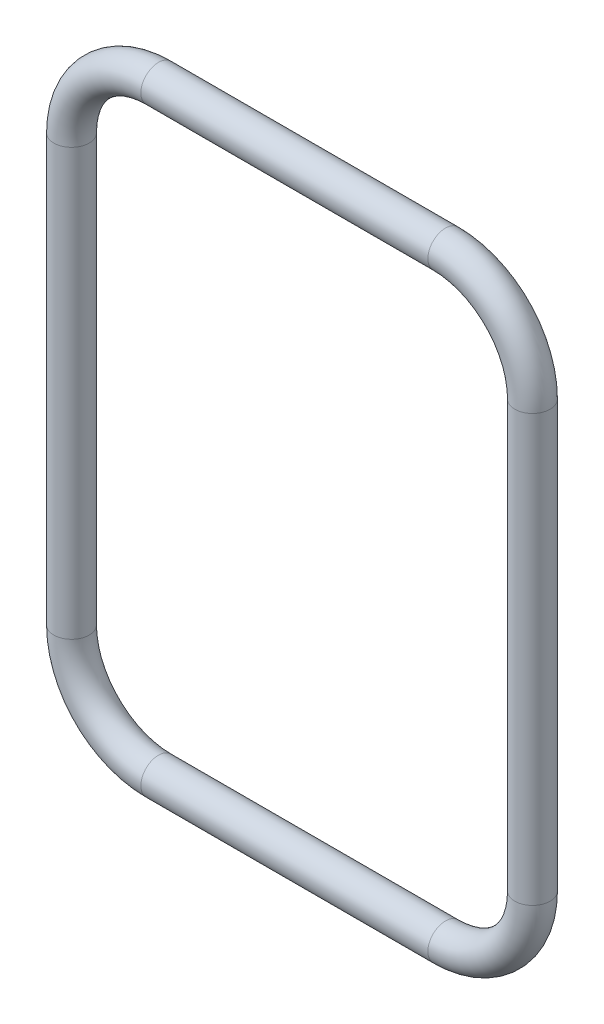
ISO-10303-21;
HEADER;
FILE_DESCRIPTION(('STEP AP214'),'2;1');
FILE_NAME('part.step','',(''),(''),'','','');
FILE_SCHEMA(('AUTOMOTIVE_DESIGN { 1 0 10303 214 1 1 1 1 }'));
ENDSEC;
DATA;
#1=APPLICATION_CONTEXT('core data for automotive mechanical design processes');
#2=APPLICATION_PROTOCOL_DEFINITION('international standard','automotive_design',2000,#1);
#3=PRODUCT_CONTEXT('',#1,'mechanical');
#4=PRODUCT('Part','Part','',(#3));
#5=PRODUCT_RELATED_PRODUCT_CATEGORY('part','',(#4));
#6=PRODUCT_DEFINITION_FORMATION('','',#4);
#7=PRODUCT_DEFINITION_CONTEXT('part definition',#1,'design');
#8=PRODUCT_DEFINITION('design','',#6,#7);
#9=PRODUCT_DEFINITION_SHAPE('','',#8);
#10=(LENGTH_UNIT() NAMED_UNIT(*) SI_UNIT(.MILLI.,.METRE.));
#11=(NAMED_UNIT(*) PLANE_ANGLE_UNIT() SI_UNIT($,.RADIAN.));
#12=(NAMED_UNIT(*) SI_UNIT($,.STERADIAN.) SOLID_ANGLE_UNIT());
#13=UNCERTAINTY_MEASURE_WITH_UNIT(LENGTH_MEASURE(1.E-05),#10,'distance_accuracy_value','');
#14=(GEOMETRIC_REPRESENTATION_CONTEXT(3) GLOBAL_UNCERTAINTY_ASSIGNED_CONTEXT((#13)) GLOBAL_UNIT_ASSIGNED_CONTEXT((#10,
#11,#12)) REPRESENTATION_CONTEXT('',''));
#15=CARTESIAN_POINT('',(0.,0.,0.));
#16=DIRECTION('',(0.,0.,1.));
#17=DIRECTION('',(1.,0.,0.));
#18=AXIS2_PLACEMENT_3D('',#15,#16,#17);
#19=CARTESIAN_POINT('',(0.577577747659383,-0.85737670420898,2.9363743209725));
#20=DIRECTION('',(0.,0.,-1.));
#21=DIRECTION('',(0.,-1.,0.));
#22=AXIS2_PLACEMENT_3D('',#19,#20,#21);
#23=TOROIDAL_SURFACE('',#22,0.35,0.071);
#24=CARTESIAN_POINT('',(0.927577747659383,-0.85737670420898,2.9363743209725));
#25=DIRECTION('',(0.,-1.,0.));
#26=DIRECTION('',(-1.,0.,0.));
#27=AXIS2_PLACEMENT_3D('',#24,#25,#26);
#28=CIRCLE('',#27,0.071);
#29=CARTESIAN_POINT('',(0.856577747659383,-0.85737670420898,2.9363743209725));
#30=VERTEX_POINT('',#29);
#31=CARTESIAN_POINT('',(0.998577747659383,-0.85737670420898,2.9363743209725));
#32=VERTEX_POINT('',#31);
#33=EDGE_CURVE('E11',#30,#32,#28,.T.);
#34=ORIENTED_EDGE('',*,*,#33,.T.);
#35=CARTESIAN_POINT('',(0.927577747659383,-0.85737670420898,2.9363743209725));
#36=DIRECTION('',(0.,-1.,0.));
#37=DIRECTION('',(-1.,0.,0.));
#38=AXIS2_PLACEMENT_3D('',#35,#36,#37);
#39=CIRCLE('',#38,0.071);
#40=EDGE_CURVE('E24',#32,#30,#39,.T.);
#41=ORIENTED_EDGE('',*,*,#40,.T.);
#42=CARTESIAN_POINT('',(0.577577747659383,-0.85737670420898,2.9363743209725));
#43=DIRECTION('',(0.,0.,-1.));
#44=DIRECTION('',(0.,-1.,0.));
#45=AXIS2_PLACEMENT_3D('',#42,#43,#44);
#46=CIRCLE('',#45,0.279);
#47=CARTESIAN_POINT('',(0.577577747659383,-1.136376704209,2.9363743209725));
#48=VERTEX_POINT('',#47);
#49=EDGE_CURVE('E138',#30,#48,#46,.T.);
#50=ORIENTED_EDGE('',*,*,#49,.T.);
#51=CARTESIAN_POINT('',(0.577577747659383,-1.207376704209,2.9363743209725));
#52=DIRECTION('',(-1.,0.,0.));
#53=DIRECTION('',(0.,1.,0.));
#54=AXIS2_PLACEMENT_3D('',#51,#52,#53);
#55=CIRCLE('',#54,0.071);
#56=CARTESIAN_POINT('',(0.577577747659383,-1.278376704209,2.9363743209725));
#57=VERTEX_POINT('',#56);
#58=EDGE_CURVE('E135',#57,#48,#55,.T.);
#59=ORIENTED_EDGE('',*,*,#58,.F.);
#60=CARTESIAN_POINT('',(0.577577747659383,-1.207376704209,2.9363743209725));
#61=DIRECTION('',(-1.,0.,0.));
#62=DIRECTION('',(0.,1.,0.));
#63=AXIS2_PLACEMENT_3D('',#60,#61,#62);
#64=CIRCLE('',#63,0.071);
#65=EDGE_CURVE('E132',#48,#57,#64,.T.);
#66=ORIENTED_EDGE('',*,*,#65,.F.);
#67=ORIENTED_EDGE('',*,*,#49,.F.);
#68=EDGE_LOOP('',(#34,#41,#50,#59,#66,#67));
#69=FACE_BOUND('',#68,.T.);
#70=ADVANCED_FACE('F17',(#69),#23,.T.);
#71=CARTESIAN_POINT('',(-0.577577747659382,-1.207376704209,2.9363743209725));
#72=DIRECTION('',(-1.,0.,0.));
#73=DIRECTION('',(0.,1.,0.));
#74=AXIS2_PLACEMENT_3D('',#71,#72,#73);
#75=CYLINDRICAL_SURFACE('',#74,0.071);
#76=ORIENTED_EDGE('',*,*,#65,.T.);
#77=DIRECTION('',(-1.,0.,0.));
#78=VECTOR('',#77,1.);
#79=CARTESIAN_POINT('',(-0.577577747659382,-1.278376704209,2.9363743209725));
#80=LINE('',#79,#78);
#81=CARTESIAN_POINT('',(-0.577577747659383,-1.278376704209,2.9363743209725));
#82=VERTEX_POINT('',#81);
#83=EDGE_CURVE('E130',#57,#82,#80,.T.);
#84=ORIENTED_EDGE('',*,*,#83,.T.);
#85=CARTESIAN_POINT('',(-0.577577747659382,-1.207376704209,2.9363743209725));
#86=DIRECTION('',(-1.,0.,0.));
#87=DIRECTION('',(0.,1.,0.));
#88=AXIS2_PLACEMENT_3D('',#85,#86,#87);
#89=CIRCLE('',#88,0.071);
#90=CARTESIAN_POINT('',(-0.577577747659382,-1.136376704209,2.9363743209725));
#91=VERTEX_POINT('',#90);
#92=EDGE_CURVE('E127',#91,#82,#89,.T.);
#93=ORIENTED_EDGE('',*,*,#92,.F.);
#94=CARTESIAN_POINT('',(-0.577577747659382,-1.207376704209,2.9363743209725));
#95=DIRECTION('',(-1.,0.,0.));
#96=DIRECTION('',(0.,1.,0.));
#97=AXIS2_PLACEMENT_3D('',#94,#95,#96);
#98=CIRCLE('',#97,0.071);
#99=EDGE_CURVE('E124',#82,#91,#98,.T.);
#100=ORIENTED_EDGE('',*,*,#99,.F.);
#101=ORIENTED_EDGE('',*,*,#83,.F.);
#102=ORIENTED_EDGE('',*,*,#58,.T.);
#103=EDGE_LOOP('',(#76,#84,#93,#100,#101,#102));
#104=FACE_BOUND('',#103,.T.);
#105=ADVANCED_FACE('F142',(#104),#75,.T.);
#106=CARTESIAN_POINT('',(-0.577577747659383,-0.857376704208981,2.9363743209725));
#107=DIRECTION('',(0.,0.,-1.));
#108=DIRECTION('',(1.,0.,0.));
#109=AXIS2_PLACEMENT_3D('',#106,#107,#108);
#110=TOROIDAL_SURFACE('',#109,0.35,0.071);
#111=ORIENTED_EDGE('',*,*,#92,.T.);
#112=ORIENTED_EDGE('',*,*,#99,.T.);
#113=CARTESIAN_POINT('',(-0.577577747659383,-0.857376704208981,2.9363743209725));
#114=DIRECTION('',(0.,0.,-1.));
#115=DIRECTION('',(1.,0.,0.));
#116=AXIS2_PLACEMENT_3D('',#113,#114,#115);
#117=CIRCLE('',#116,0.279);
#118=CARTESIAN_POINT('',(-0.856577747659383,-0.857376704208981,2.9363743209725));
#119=VERTEX_POINT('',#118);
#120=EDGE_CURVE('E122',#91,#119,#117,.T.);
#121=ORIENTED_EDGE('',*,*,#120,.T.);
#122=CARTESIAN_POINT('',(-0.927577747659382,-0.857376704208981,2.9363743209725));
#123=DIRECTION('',(0.,1.,0.));
#124=DIRECTION('',(1.,0.,0.));
#125=AXIS2_PLACEMENT_3D('',#122,#123,#124);
#126=CIRCLE('',#125,0.071);
#127=CARTESIAN_POINT('',(-0.998577747659382,-0.857376704208981,2.9363743209725));
#128=VERTEX_POINT('',#127);
#129=EDGE_CURVE('E119',#128,#119,#126,.T.);
#130=ORIENTED_EDGE('',*,*,#129,.F.);
#131=CARTESIAN_POINT('',(-0.927577747659382,-0.857376704208981,2.9363743209725));
#132=DIRECTION('',(0.,1.,0.));
#133=DIRECTION('',(1.,0.,0.));
#134=AXIS2_PLACEMENT_3D('',#131,#132,#133);
#135=CIRCLE('',#134,0.071);
#136=EDGE_CURVE('E116',#119,#128,#135,.T.);
#137=ORIENTED_EDGE('',*,*,#136,.F.);
#138=ORIENTED_EDGE('',*,*,#120,.F.);
#139=EDGE_LOOP('',(#111,#112,#121,#130,#137,#138));
#140=FACE_BOUND('',#139,.T.);
#141=ADVANCED_FACE('F146',(#140),#110,.T.);
#142=CARTESIAN_POINT('',(-0.927577747659382,0.857376704208981,2.9363743209725));
#143=DIRECTION('',(0.,1.,0.));
#144=DIRECTION('',(1.,0.,0.));
#145=AXIS2_PLACEMENT_3D('',#142,#143,#144);
#146=CYLINDRICAL_SURFACE('',#145,0.071);
#147=ORIENTED_EDGE('',*,*,#136,.T.);
#148=DIRECTION('',(0.,1.,0.));
#149=VECTOR('',#148,1.);
#150=CARTESIAN_POINT('',(-0.998577747659382,0.857376704208981,2.9363743209725));
#151=LINE('',#150,#149);
#152=CARTESIAN_POINT('',(-0.998577747659382,0.857376704208981,2.9363743209725));
#153=VERTEX_POINT('',#152);
#154=EDGE_CURVE('E114',#128,#153,#151,.T.);
#155=ORIENTED_EDGE('',*,*,#154,.T.);
#156=CARTESIAN_POINT('',(-0.927577747659382,0.857376704208981,2.9363743209725));
#157=DIRECTION('',(0.,1.,0.));
#158=DIRECTION('',(1.,0.,0.));
#159=AXIS2_PLACEMENT_3D('',#156,#157,#158);
#160=CIRCLE('',#159,0.071);
#161=CARTESIAN_POINT('',(-0.856577747659383,0.857376704208981,2.9363743209725));
#162=VERTEX_POINT('',#161);
#163=EDGE_CURVE('E111',#162,#153,#160,.T.);
#164=ORIENTED_EDGE('',*,*,#163,.F.);
#165=CARTESIAN_POINT('',(-0.927577747659382,0.857376704208981,2.9363743209725));
#166=DIRECTION('',(0.,1.,0.));
#167=DIRECTION('',(1.,0.,0.));
#168=AXIS2_PLACEMENT_3D('',#165,#166,#167);
#169=CIRCLE('',#168,0.071);
#170=EDGE_CURVE('E108',#153,#162,#169,.T.);
#171=ORIENTED_EDGE('',*,*,#170,.F.);
#172=ORIENTED_EDGE('',*,*,#154,.F.);
#173=ORIENTED_EDGE('',*,*,#129,.T.);
#174=EDGE_LOOP('',(#147,#155,#164,#171,#172,#173));
#175=FACE_BOUND('',#174,.T.);
#176=ADVANCED_FACE('F150',(#175),#146,.T.);
#177=CARTESIAN_POINT('',(-0.577577747659383,0.857376704208981,2.9363743209725));
#178=DIRECTION('',(0.,0.,-1.));
#179=DIRECTION('',(1.,0.,0.));
#180=AXIS2_PLACEMENT_3D('',#177,#178,#179);
#181=TOROIDAL_SURFACE('',#180,0.35,0.071);
#182=ORIENTED_EDGE('',*,*,#163,.T.);
#183=ORIENTED_EDGE('',*,*,#170,.T.);
#184=CARTESIAN_POINT('',(-0.577577747659383,0.857376704208981,2.9363743209725));
#185=DIRECTION('',(0.,0.,-1.));
#186=DIRECTION('',(1.,0.,0.));
#187=AXIS2_PLACEMENT_3D('',#184,#185,#186);
#188=CIRCLE('',#187,0.279);
#189=CARTESIAN_POINT('',(-0.577577747659383,1.136376704209,2.9363743209725));
#190=VERTEX_POINT('',#189);
#191=EDGE_CURVE('E106',#162,#190,#188,.T.);
#192=ORIENTED_EDGE('',*,*,#191,.T.);
#193=CARTESIAN_POINT('',(-0.577577747659383,1.207376704209,2.9363743209725));
#194=DIRECTION('',(1.,0.,0.));
#195=DIRECTION('',(0.,-1.,0.));
#196=AXIS2_PLACEMENT_3D('',#193,#194,#195);
#197=CIRCLE('',#196,0.071);
#198=CARTESIAN_POINT('',(-0.577577747659383,1.278376704209,2.9363743209725));
#199=VERTEX_POINT('',#198);
#200=EDGE_CURVE('E103',#199,#190,#197,.T.);
#201=ORIENTED_EDGE('',*,*,#200,.F.);
#202=CARTESIAN_POINT('',(-0.577577747659383,1.207376704209,2.9363743209725));
#203=DIRECTION('',(1.,0.,0.));
#204=DIRECTION('',(0.,-1.,0.));
#205=AXIS2_PLACEMENT_3D('',#202,#203,#204);
#206=CIRCLE('',#205,0.071);
#207=EDGE_CURVE('E100',#190,#199,#206,.T.);
#208=ORIENTED_EDGE('',*,*,#207,.F.);
#209=ORIENTED_EDGE('',*,*,#191,.F.);
#210=EDGE_LOOP('',(#182,#183,#192,#201,#208,#209));
#211=FACE_BOUND('',#210,.T.);
#212=ADVANCED_FACE('F154',(#211),#181,.T.);
#213=CARTESIAN_POINT('',(0.577577747659383,1.207376704209,2.9363743209725));
#214=DIRECTION('',(1.,0.,0.));
#215=DIRECTION('',(0.,-1.,0.));
#216=AXIS2_PLACEMENT_3D('',#213,#214,#215);
#217=CYLINDRICAL_SURFACE('',#216,0.071);
#218=ORIENTED_EDGE('',*,*,#207,.T.);
#219=DIRECTION('',(1.,0.,0.));
#220=VECTOR('',#219,1.);
#221=CARTESIAN_POINT('',(0.577577747659383,1.278376704209,2.9363743209725));
#222=LINE('',#221,#220);
#223=CARTESIAN_POINT('',(0.577577747659383,1.278376704209,2.9363743209725));
#224=VERTEX_POINT('',#223);
#225=EDGE_CURVE('E98',#199,#224,#222,.T.);
#226=ORIENTED_EDGE('',*,*,#225,.T.);
#227=CARTESIAN_POINT('',(0.577577747659383,1.207376704209,2.9363743209725));
#228=DIRECTION('',(1.,0.,0.));
#229=DIRECTION('',(0.,-1.,0.));
#230=AXIS2_PLACEMENT_3D('',#227,#228,#229);
#231=CIRCLE('',#230,0.071);
#232=CARTESIAN_POINT('',(0.577577747659383,1.136376704209,2.9363743209725));
#233=VERTEX_POINT('',#232);
#234=EDGE_CURVE('E96',#233,#224,#231,.T.);
#235=ORIENTED_EDGE('',*,*,#234,.F.);
#236=CARTESIAN_POINT('',(0.577577747659383,1.207376704209,2.9363743209725));
#237=DIRECTION('',(1.,0.,0.));
#238=DIRECTION('',(0.,-1.,0.));
#239=AXIS2_PLACEMENT_3D('',#236,#237,#238);
#240=CIRCLE('',#239,0.071);
#241=EDGE_CURVE('E94',#224,#233,#240,.T.);
#242=ORIENTED_EDGE('',*,*,#241,.F.);
#243=ORIENTED_EDGE('',*,*,#225,.F.);
#244=ORIENTED_EDGE('',*,*,#200,.T.);
#245=EDGE_LOOP('',(#218,#226,#235,#242,#243,#244));
#246=FACE_BOUND('',#245,.T.);
#247=ADVANCED_FACE('F158',(#246),#217,.T.);
#248=CARTESIAN_POINT('',(0.577577747659383,0.857376704208981,2.9363743209725));
#249=DIRECTION('',(0.,0.,-1.));
#250=DIRECTION('',(1.,0.,0.));
#251=AXIS2_PLACEMENT_3D('',#248,#249,#250);
#252=TOROIDAL_SURFACE('',#251,0.35,0.071);
#253=ORIENTED_EDGE('',*,*,#234,.T.);
#254=ORIENTED_EDGE('',*,*,#241,.T.);
#255=CARTESIAN_POINT('',(0.577577747659383,0.857376704208981,2.9363743209725));
#256=DIRECTION('',(0.,0.,-1.));
#257=DIRECTION('',(1.,0.,0.));
#258=AXIS2_PLACEMENT_3D('',#255,#256,#257);
#259=CIRCLE('',#258,0.279);
#260=CARTESIAN_POINT('',(0.856577747659383,0.857376704208981,2.9363743209725));
#261=VERTEX_POINT('',#260);
#262=EDGE_CURVE('E85',#233,#261,#259,.T.);
#263=ORIENTED_EDGE('',*,*,#262,.T.);
#264=CARTESIAN_POINT('',(0.927577747659383,0.857376704208981,2.9363743209725));
#265=DIRECTION('',(0.,-1.,0.));
#266=DIRECTION('',(-1.,0.,0.));
#267=AXIS2_PLACEMENT_3D('',#264,#265,#266);
#268=CIRCLE('',#267,0.071);
#269=CARTESIAN_POINT('',(0.998577747659383,0.857376704208981,2.9363743209725));
#270=VERTEX_POINT('',#269);
#271=EDGE_CURVE('E78',#270,#261,#268,.T.);
#272=ORIENTED_EDGE('',*,*,#271,.F.);
#273=CARTESIAN_POINT('',(0.927577747659383,0.857376704208981,2.9363743209725));
#274=DIRECTION('',(0.,-1.,0.));
#275=DIRECTION('',(-1.,0.,0.));
#276=AXIS2_PLACEMENT_3D('',#273,#274,#275);
#277=CIRCLE('',#276,0.071);
#278=EDGE_CURVE('E83',#261,#270,#277,.T.);
#279=ORIENTED_EDGE('',*,*,#278,.F.);
#280=ORIENTED_EDGE('',*,*,#262,.F.);
#281=EDGE_LOOP('',(#253,#254,#263,#272,#279,#280));
#282=FACE_BOUND('',#281,.T.);
#283=ADVANCED_FACE('F81',(#282),#252,.T.);
#284=CARTESIAN_POINT('',(0.927577747659383,-0.85737670420898,2.9363743209725));
#285=DIRECTION('',(0.,-1.,0.));
#286=DIRECTION('',(-1.,0.,0.));
#287=AXIS2_PLACEMENT_3D('',#284,#285,#286);
#288=CYLINDRICAL_SURFACE('',#287,0.071);
#289=ORIENTED_EDGE('',*,*,#278,.T.);
#290=DIRECTION('',(0.,-1.,0.));
#291=VECTOR('',#290,1.);
#292=CARTESIAN_POINT('',(0.998577747659383,-0.85737670420898,2.9363743209725));
#293=LINE('',#292,#291);
#294=EDGE_CURVE('E89',#270,#32,#293,.T.);
#295=ORIENTED_EDGE('',*,*,#294,.T.);
#296=ORIENTED_EDGE('',*,*,#33,.F.);
#297=ORIENTED_EDGE('',*,*,#40,.F.);
#298=ORIENTED_EDGE('',*,*,#294,.F.);
#299=ORIENTED_EDGE('',*,*,#271,.T.);
#300=EDGE_LOOP('',(#289,#295,#296,#297,#298,#299));
#301=FACE_BOUND('',#300,.T.);
#302=ADVANCED_FACE('F88',(#301),#288,.T.);
#303=CLOSED_SHELL('',(#70,#105,#141,#176,#212,#247,#283,#302));
#304=MANIFOLD_SOLID_BREP('B1',#303);
#305=ADVANCED_BREP_SHAPE_REPRESENTATION('',(#18,#304),#14);
#306=SHAPE_DEFINITION_REPRESENTATION(#9,#305);
ENDSEC;
END-ISO-10303-21;
